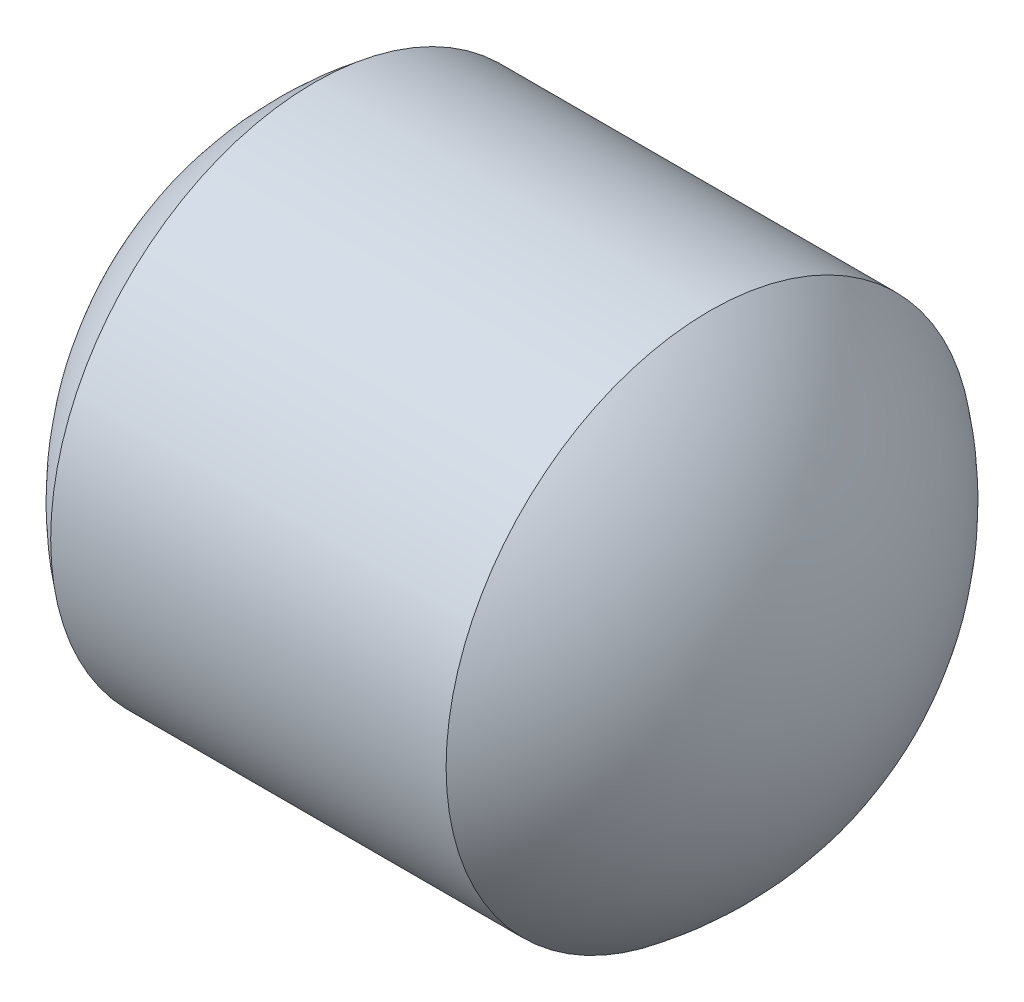
ISO-10303-21;
HEADER;
FILE_DESCRIPTION(('STEP AP214'),'2;1');
FILE_NAME('part.step','',(''),(''),'','','');
FILE_SCHEMA(('AUTOMOTIVE_DESIGN { 1 0 10303 214 1 1 1 1 }'));
ENDSEC;
DATA;
#1=APPLICATION_CONTEXT('core data for automotive mechanical design processes');
#2=APPLICATION_PROTOCOL_DEFINITION('international standard','automotive_design',2000,#1);
#3=PRODUCT_CONTEXT('',#1,'mechanical');
#4=PRODUCT('Part','Part','',(#3));
#5=PRODUCT_RELATED_PRODUCT_CATEGORY('part','',(#4));
#6=PRODUCT_DEFINITION_FORMATION('','',#4);
#7=PRODUCT_DEFINITION_CONTEXT('part definition',#1,'design');
#8=PRODUCT_DEFINITION('design','',#6,#7);
#9=PRODUCT_DEFINITION_SHAPE('','',#8);
#10=(LENGTH_UNIT() NAMED_UNIT(*) SI_UNIT(.MILLI.,.METRE.));
#11=(NAMED_UNIT(*) PLANE_ANGLE_UNIT() SI_UNIT($,.RADIAN.));
#12=(NAMED_UNIT(*) SI_UNIT($,.STERADIAN.) SOLID_ANGLE_UNIT());
#13=UNCERTAINTY_MEASURE_WITH_UNIT(LENGTH_MEASURE(1.E-05),#10,'distance_accuracy_value','');
#14=(GEOMETRIC_REPRESENTATION_CONTEXT(3) GLOBAL_UNCERTAINTY_ASSIGNED_CONTEXT((#13)) GLOBAL_UNIT_ASSIGNED_CONTEXT((#10,
#11,#12)) REPRESENTATION_CONTEXT('',''));
#15=CARTESIAN_POINT('',(0.,0.,0.));
#16=DIRECTION('',(0.,0.,1.));
#17=DIRECTION('',(1.,0.,0.));
#18=AXIS2_PLACEMENT_3D('',#15,#16,#17);
#19=CARTESIAN_POINT('',(3432.95424011185,1941.19579739616,0.));
#20=DIRECTION('',(-1.,0.,0.));
#21=DIRECTION('',(0.,1.,0.));
#22=AXIS2_PLACEMENT_3D('',#19,#20,#21);
#23=SPHERICAL_SURFACE('',#22,2.49950002500015);
#24=CARTESIAN_POINT('',(3431.45454009685,1941.19579739616,0.));
#25=DIRECTION('',(-1.,0.,0.));
#26=DIRECTION('',(0.,0.,1.));
#27=AXIS2_PLACEMENT_3D('',#24,#25,#26);
#28=CIRCLE('',#27,1.99960001999999);
#29=CARTESIAN_POINT('',(3431.45454009685,1941.19579739616,1.99960001999999));
#30=VERTEX_POINT('',#29);
#31=EDGE_CURVE('E43',#30,#30,#28,.T.);
#32=ORIENTED_EDGE('',*,*,#31,.T.);
#33=EDGE_LOOP('',(#32));
#34=FACE_BOUND('',#33,.T.);
#35=ADVANCED_FACE('F37',(#34),#23,.T.);
#36=CARTESIAN_POINT('',(3432.95424011185,1941.19579739616,0.));
#37=DIRECTION('',(-1.,0.,0.));
#38=DIRECTION('',(0.,1.,0.));
#39=AXIS2_PLACEMENT_3D('',#36,#37,#38);
#40=SPHERICAL_SURFACE('',#39,2.49950002500006);
#41=CARTESIAN_POINT('',(3434.45394012685,1941.19579739616,0.));
#42=DIRECTION('',(-1.,0.,0.));
#43=DIRECTION('',(0.,0.,1.));
#44=AXIS2_PLACEMENT_3D('',#41,#42,#43);
#45=CIRCLE('',#44,1.99960002000066);
#46=CARTESIAN_POINT('',(3434.45394012685,1941.19579739616,1.99960002000066));
#47=VERTEX_POINT('',#46);
#48=EDGE_CURVE('E10',#47,#47,#45,.T.);
#49=ORIENTED_EDGE('',*,*,#48,.F.);
#50=EDGE_LOOP('',(#49));
#51=FACE_BOUND('',#50,.T.);
#52=ADVANCED_FACE('F52',(#51),#40,.T.);
#53=CARTESIAN_POINT('',(3430.0321668746,1941.19579739616,0.));
#54=DIRECTION('',(-1.,0.,0.));
#55=DIRECTION('',(0.,0.,1.));
#56=AXIS2_PLACEMENT_3D('',#53,#54,#55);
#57=CYLINDRICAL_SURFACE('',#56,1.99960002000032);
#58=ORIENTED_EDGE('',*,*,#48,.T.);
#59=EDGE_LOOP('',(#58));
#60=FACE_BOUND('',#59,.T.);
#61=ORIENTED_EDGE('',*,*,#31,.F.);
#62=EDGE_LOOP('',(#61));
#63=FACE_BOUND('',#62,.T.);
#64=ADVANCED_FACE('F50',(#60,#63),#57,.T.);
#65=CLOSED_SHELL('',(#35,#52,#64));
#66=MANIFOLD_SOLID_BREP('B2',#65);
#67=ADVANCED_BREP_SHAPE_REPRESENTATION('',(#18,#66),#14);
#68=SHAPE_DEFINITION_REPRESENTATION(#9,#67);
ENDSEC;
END-ISO-10303-21;
